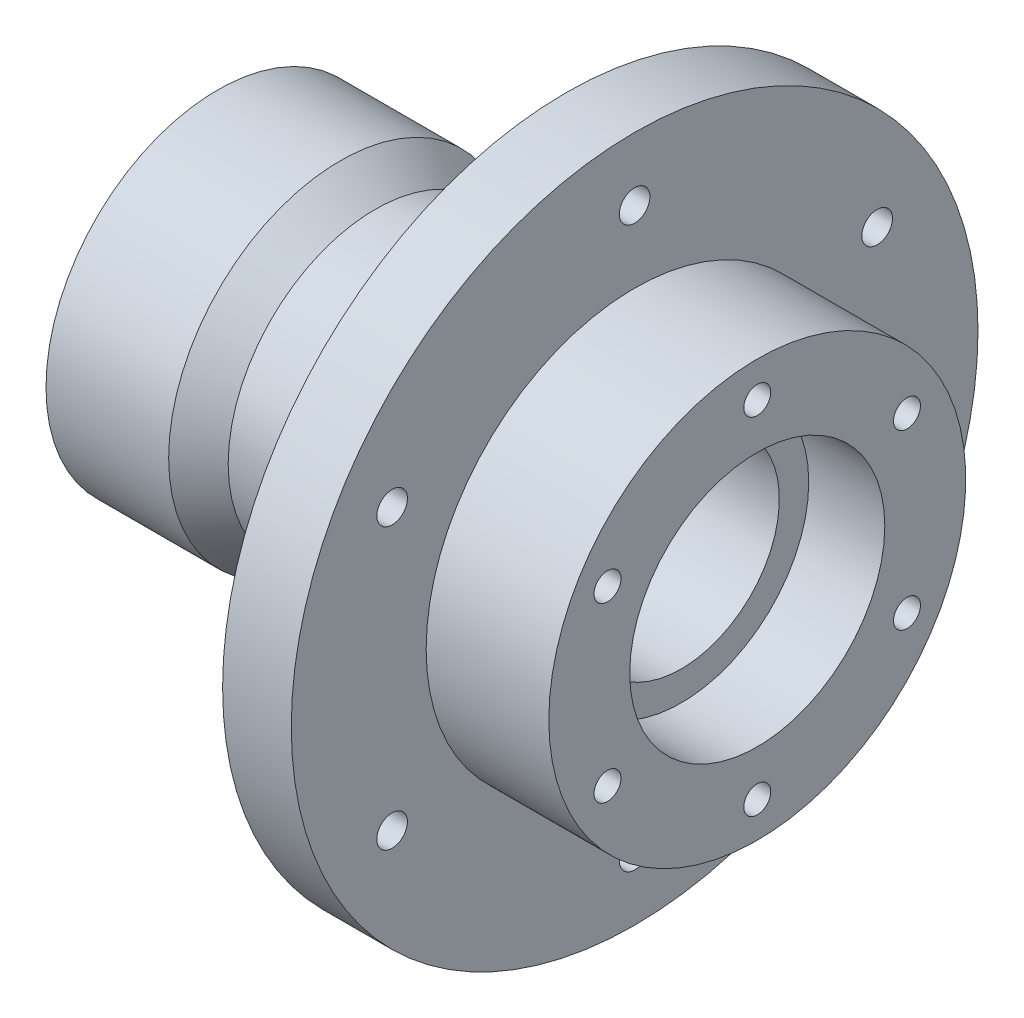
ISO-10303-21;
HEADER;
FILE_DESCRIPTION(('STEP AP214'),'2;1');
FILE_NAME('part.step','',(''),(''),'','','');
FILE_SCHEMA(('AUTOMOTIVE_DESIGN { 1 0 10303 214 1 1 1 1 }'));
ENDSEC;
DATA;
#1=APPLICATION_CONTEXT('core data for automotive mechanical design processes');
#2=APPLICATION_PROTOCOL_DEFINITION('international standard','automotive_design',2000,#1);
#3=PRODUCT_CONTEXT('',#1,'mechanical');
#4=PRODUCT('Part','Part','',(#3));
#5=PRODUCT_RELATED_PRODUCT_CATEGORY('part','',(#4));
#6=PRODUCT_DEFINITION_FORMATION('','',#4);
#7=PRODUCT_DEFINITION_CONTEXT('part definition',#1,'design');
#8=PRODUCT_DEFINITION('design','',#6,#7);
#9=PRODUCT_DEFINITION_SHAPE('','',#8);
#10=(LENGTH_UNIT() NAMED_UNIT(*) SI_UNIT(.MILLI.,.METRE.));
#11=(NAMED_UNIT(*) PLANE_ANGLE_UNIT() SI_UNIT($,.RADIAN.));
#12=(NAMED_UNIT(*) SI_UNIT($,.STERADIAN.) SOLID_ANGLE_UNIT());
#13=UNCERTAINTY_MEASURE_WITH_UNIT(LENGTH_MEASURE(1.E-05),#10,'distance_accuracy_value','');
#14=(GEOMETRIC_REPRESENTATION_CONTEXT(3) GLOBAL_UNCERTAINTY_ASSIGNED_CONTEXT((#13)) GLOBAL_UNIT_ASSIGNED_CONTEXT((#10,
#11,#12)) REPRESENTATION_CONTEXT('',''));
#15=CARTESIAN_POINT('',(0.,0.,0.));
#16=DIRECTION('',(0.,0.,1.));
#17=DIRECTION('',(1.,0.,0.));
#18=AXIS2_PLACEMENT_3D('',#15,#16,#17);
#19=CARTESIAN_POINT('',(0.,0.,0.));
#20=DIRECTION('',(-1.,0.,0.));
#21=DIRECTION('',(0.,0.,1.));
#22=AXIS2_PLACEMENT_3D('',#19,#20,#21);
#23=CYLINDRICAL_SURFACE('',#22,23.5);
#24=CARTESIAN_POINT('',(-27.2254716981132,0.,0.));
#25=DIRECTION('',(-1.,0.,0.));
#26=DIRECTION('',(0.,0.,1.));
#27=AXIS2_PLACEMENT_3D('',#24,#25,#26);
#28=CIRCLE('',#27,23.5);
#29=CARTESIAN_POINT('',(-27.2254716981132,0.,23.5));
#30=VERTEX_POINT('',#29);
#31=EDGE_CURVE('E242',#30,#30,#28,.T.);
#32=ORIENTED_EDGE('',*,*,#31,.F.);
#33=EDGE_LOOP('',(#32));
#34=FACE_BOUND('',#33,.T.);
#35=CARTESIAN_POINT('',(-41.2254716981132,0.,0.));
#36=DIRECTION('',(-1.,0.,0.));
#37=DIRECTION('',(0.,0.,1.));
#38=AXIS2_PLACEMENT_3D('',#35,#36,#37);
#39=CIRCLE('',#38,23.5);
#40=CARTESIAN_POINT('',(-41.2254716981132,0.,23.5));
#41=VERTEX_POINT('',#40);
#42=EDGE_CURVE('E180',#41,#41,#39,.T.);
#43=ORIENTED_EDGE('',*,*,#42,.T.);
#44=EDGE_LOOP('',(#43));
#45=FACE_BOUND('',#44,.T.);
#46=ADVANCED_FACE('F44',(#34,#45),#23,.F.);
#47=CARTESIAN_POINT('',(-27.2254716981132,0.,0.));
#48=DIRECTION('',(1.,0.,0.));
#49=DIRECTION('',(0.,0.,-1.));
#50=AXIS2_PLACEMENT_3D('',#47,#48,#49);
#51=PLANE('',#50);
#52=CARTESIAN_POINT('',(-27.2254716981132,0.,0.));
#53=DIRECTION('',(-1.,0.,0.));
#54=DIRECTION('',(0.,0.,1.));
#55=AXIS2_PLACEMENT_3D('',#52,#53,#54);
#56=CIRCLE('',#55,20.);
#57=CARTESIAN_POINT('',(-27.2254716981132,0.,20.));
#58=VERTEX_POINT('',#57);
#59=EDGE_CURVE('E238',#58,#58,#56,.T.);
#60=ORIENTED_EDGE('',*,*,#59,.F.);
#61=EDGE_LOOP('',(#60));
#62=FACE_BOUND('',#61,.T.);
#63=ORIENTED_EDGE('',*,*,#31,.T.);
#64=EDGE_LOOP('',(#63));
#65=FACE_BOUND('',#64,.T.);
#66=ADVANCED_FACE('F261',(#62,#65),#51,.F.);
#67=CARTESIAN_POINT('',(0.,0.,0.));
#68=DIRECTION('',(-1.,0.,0.));
#69=DIRECTION('',(0.,0.,1.));
#70=AXIS2_PLACEMENT_3D('',#67,#68,#69);
#71=CYLINDRICAL_SURFACE('',#70,20.);
#72=CARTESIAN_POINT('',(49.4245283018868,0.,0.));
#73=DIRECTION('',(-1.,0.,0.));
#74=DIRECTION('',(0.,0.,1.));
#75=AXIS2_PLACEMENT_3D('',#72,#73,#74);
#76=CIRCLE('',#75,20.);
#77=CARTESIAN_POINT('',(49.4245283018868,0.,20.));
#78=VERTEX_POINT('',#77);
#79=EDGE_CURVE('E234',#78,#78,#76,.T.);
#80=ORIENTED_EDGE('',*,*,#79,.F.);
#81=EDGE_LOOP('',(#80));
#82=FACE_BOUND('',#81,.T.);
#83=ORIENTED_EDGE('',*,*,#59,.T.);
#84=EDGE_LOOP('',(#83));
#85=FACE_BOUND('',#84,.T.);
#86=ADVANCED_FACE('F266',(#82,#85),#71,.F.);
#87=CARTESIAN_POINT('',(49.4245283018868,0.,0.));
#88=DIRECTION('',(-1.,0.,0.));
#89=DIRECTION('',(0.,0.,1.));
#90=AXIS2_PLACEMENT_3D('',#87,#88,#89);
#91=PLANE('',#90);
#92=CARTESIAN_POINT('',(49.4245283018868,0.,0.));
#93=DIRECTION('',(-1.,0.,0.));
#94=DIRECTION('',(0.,0.,1.));
#95=AXIS2_PLACEMENT_3D('',#92,#93,#94);
#96=CIRCLE('',#95,26.);
#97=CARTESIAN_POINT('',(49.4245283018868,0.,26.));
#98=VERTEX_POINT('',#97);
#99=EDGE_CURVE('E230',#98,#98,#96,.T.);
#100=ORIENTED_EDGE('',*,*,#99,.F.);
#101=EDGE_LOOP('',(#100));
#102=FACE_BOUND('',#101,.T.);
#103=ORIENTED_EDGE('',*,*,#79,.T.);
#104=EDGE_LOOP('',(#103));
#105=FACE_BOUND('',#104,.T.);
#106=ADVANCED_FACE('F274',(#102,#105),#91,.F.);
#107=CARTESIAN_POINT('',(0.,0.,0.));
#108=DIRECTION('',(-1.,0.,0.));
#109=DIRECTION('',(0.,0.,1.));
#110=AXIS2_PLACEMENT_3D('',#107,#108,#109);
#111=CYLINDRICAL_SURFACE('',#110,26.);
#112=CARTESIAN_POINT('',(64.9245283018868,0.,0.));
#113=DIRECTION('',(-1.,0.,0.));
#114=DIRECTION('',(0.,0.,1.));
#115=AXIS2_PLACEMENT_3D('',#112,#113,#114);
#116=CIRCLE('',#115,26.);
#117=CARTESIAN_POINT('',(64.9245283018868,0.,26.));
#118=VERTEX_POINT('',#117);
#119=EDGE_CURVE('E226',#118,#118,#116,.T.);
#120=ORIENTED_EDGE('',*,*,#119,.F.);
#121=EDGE_LOOP('',(#120));
#122=FACE_BOUND('',#121,.T.);
#123=ORIENTED_EDGE('',*,*,#99,.T.);
#124=EDGE_LOOP('',(#123));
#125=FACE_BOUND('',#124,.T.);
#126=ADVANCED_FACE('F278',(#122,#125),#111,.F.);
#127=CARTESIAN_POINT('',(64.9245283018868,0.,0.));
#128=DIRECTION('',(-1.,0.,0.));
#129=DIRECTION('',(0.,0.,1.));
#130=AXIS2_PLACEMENT_3D('',#127,#128,#129);
#131=PLANE('',#130);
#132=CARTESIAN_POINT('',(64.9245283018868,17.6250000000004,30.5273954834013));
#133=DIRECTION('',(1.,0.,0.));
#134=DIRECTION('',(0.,0.,-1.));
#135=AXIS2_PLACEMENT_3D('',#132,#133,#134);
#136=CIRCLE('',#135,2.74999999999999);
#137=CARTESIAN_POINT('',(64.9245283018868,17.6250000000004,27.7773954834013));
#138=VERTEX_POINT('',#137);
#139=EDGE_CURVE('E84',#138,#138,#136,.T.);
#140=ORIENTED_EDGE('',*,*,#139,.F.);
#141=EDGE_LOOP('',(#140));
#142=FACE_BOUND('',#141,.T.);
#143=CARTESIAN_POINT('',(64.9245283018868,-17.6249999999997,30.5273954834016));
#144=DIRECTION('',(1.,0.,0.));
#145=DIRECTION('',(0.,0.,-1.));
#146=AXIS2_PLACEMENT_3D('',#143,#144,#145);
#147=CIRCLE('',#146,2.74999999999999);
#148=CARTESIAN_POINT('',(64.9245283018868,-17.6249999999997,27.7773954834016));
#149=VERTEX_POINT('',#148);
#150=EDGE_CURVE('E83',#149,#149,#147,.T.);
#151=ORIENTED_EDGE('',*,*,#150,.F.);
#152=EDGE_LOOP('',(#151));
#153=FACE_BOUND('',#152,.T.);
#154=CARTESIAN_POINT('',(64.9245283018868,-35.25,0.));
#155=DIRECTION('',(1.,0.,0.));
#156=DIRECTION('',(0.,0.,-1.));
#157=AXIS2_PLACEMENT_3D('',#154,#155,#156);
#158=CIRCLE('',#157,2.74999999999999);
#159=CARTESIAN_POINT('',(64.9245283018868,-35.25,-2.74999999999999));
#160=VERTEX_POINT('',#159);
#161=EDGE_CURVE('E100',#160,#160,#158,.T.);
#162=ORIENTED_EDGE('',*,*,#161,.F.);
#163=EDGE_LOOP('',(#162));
#164=FACE_BOUND('',#163,.T.);
#165=CARTESIAN_POINT('',(64.9245283018868,-17.6250000000001,-30.5273954834014));
#166=DIRECTION('',(1.,0.,0.));
#167=DIRECTION('',(0.,0.,-1.));
#168=AXIS2_PLACEMENT_3D('',#165,#166,#167);
#169=CIRCLE('',#168,2.74999999999999);
#170=CARTESIAN_POINT('',(64.9245283018868,-17.6250000000001,-33.2773954834014));
#171=VERTEX_POINT('',#170);
#172=EDGE_CURVE('E108',#171,#171,#169,.T.);
#173=ORIENTED_EDGE('',*,*,#172,.F.);
#174=EDGE_LOOP('',(#173));
#175=FACE_BOUND('',#174,.T.);
#176=CARTESIAN_POINT('',(64.9245283018868,17.6249999999999,-30.5273954834015));
#177=DIRECTION('',(1.,0.,0.));
#178=DIRECTION('',(0.,0.,-1.));
#179=AXIS2_PLACEMENT_3D('',#176,#177,#178);
#180=CIRCLE('',#179,2.74999999999999);
#181=CARTESIAN_POINT('',(64.9245283018868,17.6249999999999,-33.2773954834015));
#182=VERTEX_POINT('',#181);
#183=EDGE_CURVE('E116',#182,#182,#180,.T.);
#184=ORIENTED_EDGE('',*,*,#183,.F.);
#185=EDGE_LOOP('',(#184));
#186=FACE_BOUND('',#185,.T.);
#187=CARTESIAN_POINT('',(64.9245283018868,35.25,0.));
#188=DIRECTION('',(1.,0.,0.));
#189=DIRECTION('',(0.,0.,-1.));
#190=AXIS2_PLACEMENT_3D('',#187,#188,#189);
#191=CIRCLE('',#190,2.74999999999999);
#192=CARTESIAN_POINT('',(64.9245283018868,35.25,-2.74999999999999));
#193=VERTEX_POINT('',#192);
#194=EDGE_CURVE('E164',#193,#193,#191,.T.);
#195=ORIENTED_EDGE('',*,*,#194,.F.);
#196=EDGE_LOOP('',(#195));
#197=FACE_BOUND('',#196,.T.);
#198=CARTESIAN_POINT('',(64.9245283018868,0.,0.));
#199=DIRECTION('',(-1.,0.,0.));
#200=DIRECTION('',(0.,0.,1.));
#201=AXIS2_PLACEMENT_3D('',#198,#199,#200);
#202=CIRCLE('',#201,42.5);
#203=CARTESIAN_POINT('',(64.9245283018868,0.,42.5));
#204=VERTEX_POINT('',#203);
#205=EDGE_CURVE('E222',#204,#204,#202,.T.);
#206=ORIENTED_EDGE('',*,*,#205,.F.);
#207=EDGE_LOOP('',(#206));
#208=FACE_BOUND('',#207,.T.);
#209=ORIENTED_EDGE('',*,*,#119,.T.);
#210=EDGE_LOOP('',(#209));
#211=FACE_BOUND('',#210,.T.);
#212=ADVANCED_FACE('F282',(#142,#153,#164,#175,#186,#197,#208,#211),#131,.F.);
#213=CARTESIAN_POINT('',(0.,0.,0.));
#214=DIRECTION('',(-1.,0.,0.));
#215=DIRECTION('',(0.,0.,1.));
#216=AXIS2_PLACEMENT_3D('',#213,#214,#215);
#217=CYLINDRICAL_SURFACE('',#216,42.5);
#218=CARTESIAN_POINT('',(39.9245283018868,0.,0.));
#219=DIRECTION('',(-1.,0.,0.));
#220=DIRECTION('',(0.,0.,1.));
#221=AXIS2_PLACEMENT_3D('',#218,#219,#220);
#222=CIRCLE('',#221,42.5);
#223=CARTESIAN_POINT('',(39.9245283018868,0.,42.5));
#224=VERTEX_POINT('',#223);
#225=EDGE_CURVE('E219',#224,#224,#222,.T.);
#226=ORIENTED_EDGE('',*,*,#225,.F.);
#227=EDGE_LOOP('',(#226));
#228=FACE_BOUND('',#227,.T.);
#229=ORIENTED_EDGE('',*,*,#205,.T.);
#230=EDGE_LOOP('',(#229));
#231=FACE_BOUND('',#230,.T.);
#232=ADVANCED_FACE('F286',(#228,#231),#217,.T.);
#233=CARTESIAN_POINT('',(39.9245283018868,0.,0.));
#234=DIRECTION('',(-1.,0.,0.));
#235=DIRECTION('',(0.,0.,1.));
#236=AXIS2_PLACEMENT_3D('',#233,#234,#235);
#237=PLANE('',#236);
#238=CARTESIAN_POINT('',(39.9245283018868,28.5450000000006,49.4413903020533));
#239=DIRECTION('',(1.,0.,0.));
#240=DIRECTION('',(0.,0.866025403784433,-0.50000000000001));
#241=AXIS2_PLACEMENT_3D('',#238,#239,#240);
#242=CIRCLE('',#241,3.125);
#243=CARTESIAN_POINT('',(39.9245283018868,31.2513293868269,47.8788903020532));
#244=VERTEX_POINT('',#243);
#245=EDGE_CURVE('E124',#244,#244,#242,.T.);
#246=ORIENTED_EDGE('',*,*,#245,.F.);
#247=EDGE_LOOP('',(#246));
#248=FACE_BOUND('',#247,.T.);
#249=CARTESIAN_POINT('',(39.9245283018868,-28.5449999999995,49.4413903020539));
#250=DIRECTION('',(1.,0.,0.));
#251=DIRECTION('',(0.,0.866025403784443,0.499999999999992));
#252=AXIS2_PLACEMENT_3D('',#249,#250,#251);
#253=CIRCLE('',#252,3.125);
#254=CARTESIAN_POINT('',(39.9245283018868,-25.8386706131732,51.0038903020538));
#255=VERTEX_POINT('',#254);
#256=EDGE_CURVE('E143',#255,#255,#253,.T.);
#257=ORIENTED_EDGE('',*,*,#256,.F.);
#258=EDGE_LOOP('',(#257));
#259=FACE_BOUND('',#258,.T.);
#260=CARTESIAN_POINT('',(39.9245283018868,-57.09,0.));
#261=DIRECTION('',(1.,0.,0.));
#262=DIRECTION('',(0.,0.,1.));
#263=AXIS2_PLACEMENT_3D('',#260,#261,#262);
#264=CIRCLE('',#263,3.125);
#265=CARTESIAN_POINT('',(39.9245283018868,-57.09,3.125));
#266=VERTEX_POINT('',#265);
#267=EDGE_CURVE('E135',#266,#266,#264,.T.);
#268=ORIENTED_EDGE('',*,*,#267,.F.);
#269=EDGE_LOOP('',(#268));
#270=FACE_BOUND('',#269,.T.);
#271=CARTESIAN_POINT('',(39.9245283018868,-28.5450000000002,-49.4413903020535));
#272=DIRECTION('',(1.,0.,0.));
#273=DIRECTION('',(0.,-0.866025403784436,0.500000000000004));
#274=AXIS2_PLACEMENT_3D('',#271,#272,#273);
#275=CIRCLE('',#274,3.125);
#276=CARTESIAN_POINT('',(39.9245283018868,-31.2513293868266,-47.8788903020535));
#277=VERTEX_POINT('',#276);
#278=EDGE_CURVE('E125',#277,#277,#275,.T.);
#279=ORIENTED_EDGE('',*,*,#278,.F.);
#280=EDGE_LOOP('',(#279));
#281=FACE_BOUND('',#280,.T.);
#282=CARTESIAN_POINT('',(39.9245283018868,28.5449999999999,-49.4413903020537));
#283=DIRECTION('',(1.,0.,0.));
#284=DIRECTION('',(0.,-0.86602540378444,-0.499999999999998));
#285=AXIS2_PLACEMENT_3D('',#282,#283,#284);
#286=CIRCLE('',#285,3.125);
#287=CARTESIAN_POINT('',(39.9245283018868,25.8386706131735,-51.0038903020537));
#288=VERTEX_POINT('',#287);
#289=EDGE_CURVE('E134',#288,#288,#286,.T.);
#290=ORIENTED_EDGE('',*,*,#289,.F.);
#291=EDGE_LOOP('',(#290));
#292=FACE_BOUND('',#291,.T.);
#293=CARTESIAN_POINT('',(39.9245283018868,57.09,0.));
#294=DIRECTION('',(1.,0.,0.));
#295=DIRECTION('',(0.,0.,-1.));
#296=AXIS2_PLACEMENT_3D('',#293,#294,#295);
#297=CIRCLE('',#296,3.125);
#298=CARTESIAN_POINT('',(39.9245283018868,57.09,-3.125));
#299=VERTEX_POINT('',#298);
#300=EDGE_CURVE('E172',#299,#299,#297,.T.);
#301=ORIENTED_EDGE('',*,*,#300,.F.);
#302=EDGE_LOOP('',(#301));
#303=FACE_BOUND('',#302,.T.);
#304=CARTESIAN_POINT('',(39.9245283018868,0.,0.));
#305=DIRECTION('',(-1.,0.,0.));
#306=DIRECTION('',(0.,0.,1.));
#307=AXIS2_PLACEMENT_3D('',#304,#305,#306);
#308=CIRCLE('',#307,70.);
#309=CARTESIAN_POINT('',(39.9245283018868,0.,70.));
#310=VERTEX_POINT('',#309);
#311=EDGE_CURVE('E215',#310,#310,#308,.T.);
#312=ORIENTED_EDGE('',*,*,#311,.F.);
#313=EDGE_LOOP('',(#312));
#314=FACE_BOUND('',#313,.T.);
#315=ORIENTED_EDGE('',*,*,#225,.T.);
#316=EDGE_LOOP('',(#315));
#317=FACE_BOUND('',#316,.T.);
#318=ADVANCED_FACE('F290',(#248,#259,#270,#281,#292,#303,#314,#317),#237,.F.);
#319=CARTESIAN_POINT('',(0.,0.,0.));
#320=DIRECTION('',(-1.,0.,0.));
#321=DIRECTION('',(0.,0.,1.));
#322=AXIS2_PLACEMENT_3D('',#319,#320,#321);
#323=CYLINDRICAL_SURFACE('',#322,70.);
#324=CARTESIAN_POINT('',(25.9245283018868,0.,0.));
#325=DIRECTION('',(-1.,0.,0.));
#326=DIRECTION('',(0.,0.,1.));
#327=AXIS2_PLACEMENT_3D('',#324,#325,#326);
#328=CIRCLE('',#327,70.);
#329=CARTESIAN_POINT('',(25.9245283018868,0.,70.));
#330=VERTEX_POINT('',#329);
#331=EDGE_CURVE('E211',#330,#330,#328,.T.);
#332=ORIENTED_EDGE('',*,*,#331,.F.);
#333=EDGE_LOOP('',(#332));
#334=FACE_BOUND('',#333,.T.);
#335=ORIENTED_EDGE('',*,*,#311,.T.);
#336=EDGE_LOOP('',(#335));
#337=FACE_BOUND('',#336,.T.);
#338=ADVANCED_FACE('F294',(#334,#337),#323,.T.);
#339=CARTESIAN_POINT('',(25.9245283018868,0.,0.));
#340=DIRECTION('',(1.,0.,0.));
#341=DIRECTION('',(0.,0.,-1.));
#342=AXIS2_PLACEMENT_3D('',#339,#340,#341);
#343=PLANE('',#342);
#344=CARTESIAN_POINT('',(25.9245283018868,0.,0.));
#345=DIRECTION('',(1.,0.,0.));
#346=DIRECTION('',(0.,0.,-1.));
#347=AXIS2_PLACEMENT_3D('',#344,#345,#346);
#348=CIRCLE('',#347,33.);
#349=CARTESIAN_POINT('',(25.9245283018868,0.,-33.));
#350=VERTEX_POINT('',#349);
#351=EDGE_CURVE('E11',#350,#350,#348,.T.);
#352=ORIENTED_EDGE('',*,*,#351,.T.);
#353=EDGE_LOOP('',(#352));
#354=FACE_BOUND('',#353,.T.);
#355=CARTESIAN_POINT('',(25.9245283018868,28.5450000000006,49.4413903020533));
#356=DIRECTION('',(1.,0.,0.));
#357=DIRECTION('',(0.,0.,-1.));
#358=AXIS2_PLACEMENT_3D('',#355,#356,#357);
#359=CIRCLE('',#358,3.125);
#360=CARTESIAN_POINT('',(25.9245283018868,28.5450000000006,46.3163903020533));
#361=VERTEX_POINT('',#360);
#362=EDGE_CURVE('E147',#361,#361,#359,.F.);
#363=ORIENTED_EDGE('',*,*,#362,.F.);
#364=EDGE_LOOP('',(#363));
#365=FACE_BOUND('',#364,.T.);
#366=CARTESIAN_POINT('',(25.9245283018868,-28.5449999999995,49.4413903020539));
#367=DIRECTION('',(1.,0.,0.));
#368=DIRECTION('',(0.,0.,-1.));
#369=AXIS2_PLACEMENT_3D('',#366,#367,#368);
#370=CIRCLE('',#369,3.125);
#371=CARTESIAN_POINT('',(25.9245283018868,-28.5449999999995,46.3163903020539));
#372=VERTEX_POINT('',#371);
#373=EDGE_CURVE('E139',#372,#372,#370,.F.);
#374=ORIENTED_EDGE('',*,*,#373,.F.);
#375=EDGE_LOOP('',(#374));
#376=FACE_BOUND('',#375,.T.);
#377=CARTESIAN_POINT('',(25.9245283018868,-57.09,0.));
#378=DIRECTION('',(1.,0.,0.));
#379=DIRECTION('',(0.,0.,-1.));
#380=AXIS2_PLACEMENT_3D('',#377,#378,#379);
#381=CIRCLE('',#380,3.125);
#382=CARTESIAN_POINT('',(25.9245283018868,-57.09,-3.125));
#383=VERTEX_POINT('',#382);
#384=EDGE_CURVE('E130',#383,#383,#381,.F.);
#385=ORIENTED_EDGE('',*,*,#384,.F.);
#386=EDGE_LOOP('',(#385));
#387=FACE_BOUND('',#386,.T.);
#388=CARTESIAN_POINT('',(25.9245283018868,-28.5450000000002,-49.4413903020535));
#389=DIRECTION('',(1.,0.,0.));
#390=DIRECTION('',(0.,0.,-1.));
#391=AXIS2_PLACEMENT_3D('',#388,#389,#390);
#392=CIRCLE('',#391,3.125);
#393=CARTESIAN_POINT('',(25.9245283018868,-28.5450000000002,-52.5663903020535));
#394=VERTEX_POINT('',#393);
#395=EDGE_CURVE('E129',#394,#394,#392,.F.);
#396=ORIENTED_EDGE('',*,*,#395,.F.);
#397=EDGE_LOOP('',(#396));
#398=FACE_BOUND('',#397,.T.);
#399=CARTESIAN_POINT('',(25.9245283018868,28.5449999999999,-49.4413903020537));
#400=DIRECTION('',(1.,0.,0.));
#401=DIRECTION('',(0.,0.,-1.));
#402=AXIS2_PLACEMENT_3D('',#399,#400,#401);
#403=CIRCLE('',#402,3.125);
#404=CARTESIAN_POINT('',(25.9245283018868,28.5449999999999,-52.5663903020537));
#405=VERTEX_POINT('',#404);
#406=EDGE_CURVE('E160',#405,#405,#403,.F.);
#407=ORIENTED_EDGE('',*,*,#406,.F.);
#408=EDGE_LOOP('',(#407));
#409=FACE_BOUND('',#408,.T.);
#410=CARTESIAN_POINT('',(25.9245283018868,57.09,0.));
#411=DIRECTION('',(1.,0.,0.));
#412=DIRECTION('',(0.,0.,-1.));
#413=AXIS2_PLACEMENT_3D('',#410,#411,#412);
#414=CIRCLE('',#413,3.125);
#415=CARTESIAN_POINT('',(25.9245283018868,57.09,-3.125));
#416=VERTEX_POINT('',#415);
#417=EDGE_CURVE('E176',#416,#416,#414,.F.);
#418=ORIENTED_EDGE('',*,*,#417,.F.);
#419=EDGE_LOOP('',(#418));
#420=FACE_BOUND('',#419,.T.);
#421=ORIENTED_EDGE('',*,*,#331,.T.);
#422=EDGE_LOOP('',(#421));
#423=FACE_BOUND('',#422,.T.);
#424=ADVANCED_FACE('F298',(#354,#365,#376,#387,#398,#409,#420,#423),#343,.F.);
#425=CARTESIAN_POINT('',(0.,0.,0.));
#426=DIRECTION('',(-1.,0.,0.));
#427=DIRECTION('',(0.,0.,1.));
#428=AXIS2_PLACEMENT_3D('',#425,#426,#427);
#429=CYLINDRICAL_SURFACE('',#428,30.);
#430=CARTESIAN_POINT('',(22.9245283018868,0.,0.));
#431=DIRECTION('',(1.,0.,0.));
#432=DIRECTION('',(0.,0.,-1.));
#433=AXIS2_PLACEMENT_3D('',#430,#431,#432);
#434=CIRCLE('',#433,30.);
#435=CARTESIAN_POINT('',(22.9245283018868,0.,-30.));
#436=VERTEX_POINT('',#435);
#437=EDGE_CURVE('E53',#436,#436,#434,.F.);
#438=ORIENTED_EDGE('',*,*,#437,.T.);
#439=EDGE_LOOP('',(#438));
#440=FACE_BOUND('',#439,.T.);
#441=CARTESIAN_POINT('',(-12.9347316644025,0.,0.));
#442=DIRECTION('',(-1.,0.,0.));
#443=DIRECTION('',(0.,0.,1.));
#444=AXIS2_PLACEMENT_3D('',#441,#442,#443);
#445=CIRCLE('',#444,30.);
#446=CARTESIAN_POINT('',(-12.9347316644025,0.,30.));
#447=VERTEX_POINT('',#446);
#448=EDGE_CURVE('E207',#447,#447,#445,.T.);
#449=ORIENTED_EDGE('',*,*,#448,.F.);
#450=EDGE_LOOP('',(#449));
#451=FACE_BOUND('',#450,.T.);
#452=ADVANCED_FACE('F250',(#440,#451),#429,.T.);
#453=CARTESIAN_POINT('',(-12.9347316644025,0.,0.));
#454=DIRECTION('',(-1.,0.,0.));
#455=DIRECTION('',(0.,0.,1.));
#456=AXIS2_PLACEMENT_3D('',#453,#454,#455);
#457=CONICAL_SURFACE('',#456,30.,0.610865238198009);
#458=CARTESIAN_POINT('',(-20.0754716981132,0.,0.));
#459=DIRECTION('',(-1.,0.,0.));
#460=DIRECTION('',(0.,0.,1.));
#461=AXIS2_PLACEMENT_3D('',#458,#459,#460);
#462=CIRCLE('',#461,35.);
#463=CARTESIAN_POINT('',(-20.0754716981132,0.,35.));
#464=VERTEX_POINT('',#463);
#465=EDGE_CURVE('E203',#464,#464,#462,.T.);
#466=ORIENTED_EDGE('',*,*,#465,.F.);
#467=EDGE_LOOP('',(#466));
#468=FACE_BOUND('',#467,.T.);
#469=ORIENTED_EDGE('',*,*,#448,.T.);
#470=EDGE_LOOP('',(#469));
#471=FACE_BOUND('',#470,.T.);
#472=ADVANCED_FACE('F305',(#468,#471),#457,.T.);
#473=CARTESIAN_POINT('',(0.,0.,0.));
#474=DIRECTION('',(-1.,0.,0.));
#475=DIRECTION('',(0.,0.,1.));
#476=AXIS2_PLACEMENT_3D('',#473,#474,#475);
#477=CYLINDRICAL_SURFACE('',#476,35.);
#478=CARTESIAN_POINT('',(-45.0754716981132,0.,0.));
#479=DIRECTION('',(-1.,0.,0.));
#480=DIRECTION('',(0.,0.,1.));
#481=AXIS2_PLACEMENT_3D('',#478,#479,#480);
#482=CIRCLE('',#481,35.);
#483=CARTESIAN_POINT('',(-45.0754716981132,0.,35.));
#484=VERTEX_POINT('',#483);
#485=EDGE_CURVE('E199',#484,#484,#482,.T.);
#486=ORIENTED_EDGE('',*,*,#485,.F.);
#487=EDGE_LOOP('',(#486));
#488=FACE_BOUND('',#487,.T.);
#489=ORIENTED_EDGE('',*,*,#465,.T.);
#490=EDGE_LOOP('',(#489));
#491=FACE_BOUND('',#490,.T.);
#492=ADVANCED_FACE('F308',(#488,#491),#477,.T.);
#493=CARTESIAN_POINT('',(-45.0754716981132,0.,0.));
#494=DIRECTION('',(1.,0.,0.));
#495=DIRECTION('',(0.,0.,-1.));
#496=AXIS2_PLACEMENT_3D('',#493,#494,#495);
#497=PLANE('',#496);
#498=CARTESIAN_POINT('',(-45.0754716981132,0.,0.));
#499=DIRECTION('',(-1.,0.,0.));
#500=DIRECTION('',(0.,0.,1.));
#501=AXIS2_PLACEMENT_3D('',#498,#499,#500);
#502=CIRCLE('',#501,23.5);
#503=CARTESIAN_POINT('',(-45.0754716981132,0.,23.5));
#504=VERTEX_POINT('',#503);
#505=EDGE_CURVE('E195',#504,#504,#502,.T.);
#506=ORIENTED_EDGE('',*,*,#505,.F.);
#507=EDGE_LOOP('',(#506));
#508=FACE_BOUND('',#507,.T.);
#509=ORIENTED_EDGE('',*,*,#485,.T.);
#510=EDGE_LOOP('',(#509));
#511=FACE_BOUND('',#510,.T.);
#512=ADVANCED_FACE('F312',(#508,#511),#497,.F.);
#513=CARTESIAN_POINT('',(0.,0.,0.));
#514=DIRECTION('',(-1.,0.,0.));
#515=DIRECTION('',(0.,0.,1.));
#516=AXIS2_PLACEMENT_3D('',#513,#514,#515);
#517=CYLINDRICAL_SURFACE('',#516,23.5);
#518=CARTESIAN_POINT('',(-43.0754716981132,0.,0.));
#519=DIRECTION('',(-1.,0.,0.));
#520=DIRECTION('',(0.,0.,1.));
#521=AXIS2_PLACEMENT_3D('',#518,#519,#520);
#522=CIRCLE('',#521,23.5);
#523=CARTESIAN_POINT('',(-43.0754716981132,0.,23.5));
#524=VERTEX_POINT('',#523);
#525=EDGE_CURVE('E191',#524,#524,#522,.T.);
#526=ORIENTED_EDGE('',*,*,#525,.F.);
#527=EDGE_LOOP('',(#526));
#528=FACE_BOUND('',#527,.T.);
#529=ORIENTED_EDGE('',*,*,#505,.T.);
#530=EDGE_LOOP('',(#529));
#531=FACE_BOUND('',#530,.T.);
#532=ADVANCED_FACE('F316',(#528,#531),#517,.F.);
#533=CARTESIAN_POINT('',(-43.0754716981132,0.,0.));
#534=DIRECTION('',(-1.,0.,0.));
#535=DIRECTION('',(0.,0.,1.));
#536=AXIS2_PLACEMENT_3D('',#533,#534,#535);
#537=PLANE('',#536);
#538=CARTESIAN_POINT('',(-43.0754716981132,0.,0.));
#539=DIRECTION('',(-1.,0.,0.));
#540=DIRECTION('',(0.,0.,1.));
#541=AXIS2_PLACEMENT_3D('',#538,#539,#540);
#542=CIRCLE('',#541,24.75);
#543=CARTESIAN_POINT('',(-43.0754716981132,0.,24.75));
#544=VERTEX_POINT('',#543);
#545=EDGE_CURVE('E188',#544,#544,#542,.T.);
#546=ORIENTED_EDGE('',*,*,#545,.F.);
#547=EDGE_LOOP('',(#546));
#548=FACE_BOUND('',#547,.T.);
#549=ORIENTED_EDGE('',*,*,#525,.T.);
#550=EDGE_LOOP('',(#549));
#551=FACE_BOUND('',#550,.T.);
#552=ADVANCED_FACE('F320',(#548,#551),#537,.F.);
#553=CARTESIAN_POINT('',(0.,0.,0.));
#554=DIRECTION('',(-1.,0.,0.));
#555=DIRECTION('',(0.,0.,1.));
#556=AXIS2_PLACEMENT_3D('',#553,#554,#555);
#557=CYLINDRICAL_SURFACE('',#556,24.75);
#558=CARTESIAN_POINT('',(-41.2254716981132,0.,0.));
#559=DIRECTION('',(-1.,0.,0.));
#560=DIRECTION('',(0.,0.,1.));
#561=AXIS2_PLACEMENT_3D('',#558,#559,#560);
#562=CIRCLE('',#561,24.75);
#563=CARTESIAN_POINT('',(-41.2254716981132,0.,24.75));
#564=VERTEX_POINT('',#563);
#565=EDGE_CURVE('E184',#564,#564,#562,.T.);
#566=ORIENTED_EDGE('',*,*,#565,.F.);
#567=EDGE_LOOP('',(#566));
#568=FACE_BOUND('',#567,.T.);
#569=ORIENTED_EDGE('',*,*,#545,.T.);
#570=EDGE_LOOP('',(#569));
#571=FACE_BOUND('',#570,.T.);
#572=ADVANCED_FACE('F324',(#568,#571),#557,.F.);
#573=CARTESIAN_POINT('',(-41.2254716981132,-2.28847339401389E-13,0.));
#574=DIRECTION('',(1.,0.,0.));
#575=DIRECTION('',(0.,0.,-1.));
#576=AXIS2_PLACEMENT_3D('',#573,#574,#575);
#577=PLANE('',#576);
#578=ORIENTED_EDGE('',*,*,#42,.F.);
#579=EDGE_LOOP('',(#578));
#580=FACE_BOUND('',#579,.T.);
#581=ORIENTED_EDGE('',*,*,#565,.T.);
#582=EDGE_LOOP('',(#581));
#583=FACE_BOUND('',#582,.T.);
#584=ADVANCED_FACE('F328',(#580,#583),#577,.F.);
#585=CARTESIAN_POINT('',(17.085693537055,57.09,0.));
#586=DIRECTION('',(1.,0.,0.));
#587=DIRECTION('',(0.,0.,-1.));
#588=AXIS2_PLACEMENT_3D('',#585,#586,#587);
#589=CYLINDRICAL_SURFACE('',#588,3.125);
#590=ORIENTED_EDGE('',*,*,#417,.T.);
#591=EDGE_LOOP('',(#590));
#592=FACE_BOUND('',#591,.T.);
#593=ORIENTED_EDGE('',*,*,#300,.T.);
#594=EDGE_LOOP('',(#593));
#595=FACE_BOUND('',#594,.T.);
#596=ADVANCED_FACE('F332',(#592,#595),#589,.F.);
#597=CARTESIAN_POINT('',(54.5768950042126,35.25,0.));
#598=DIRECTION('',(1.,0.,0.));
#599=DIRECTION('',(0.,0.,-1.));
#600=AXIS2_PLACEMENT_3D('',#597,#598,#599);
#601=CONICAL_SURFACE('',#600,2.75,1.02974425867665);
#602=CARTESIAN_POINT('',(52.9245283018868,35.25,0.));
#603=VERTEX_POINT('',#602);
#604=VERTEX_LOOP('',#603);
#605=FACE_BOUND('',#604,.T.);
#606=CARTESIAN_POINT('',(54.5768950042126,35.25,0.));
#607=DIRECTION('',(1.,0.,0.));
#608=DIRECTION('',(0.,0.,-1.));
#609=AXIS2_PLACEMENT_3D('',#606,#607,#608);
#610=CIRCLE('',#609,2.75);
#611=CARTESIAN_POINT('',(54.5768950042126,35.25,-2.75));
#612=VERTEX_POINT('',#611);
#613=EDGE_CURVE('E168',#612,#612,#610,.T.);
#614=ORIENTED_EDGE('',*,*,#613,.T.);
#615=EDGE_LOOP('',(#614));
#616=FACE_BOUND('',#615,.T.);
#617=ADVANCED_FACE('F336',(#605,#616),#601,.F.);
#618=CARTESIAN_POINT('',(64.9245283018868,35.25,0.));
#619=DIRECTION('',(1.,0.,0.));
#620=DIRECTION('',(0.,0.,-1.));
#621=AXIS2_PLACEMENT_3D('',#618,#619,#620);
#622=CYLINDRICAL_SURFACE('',#621,2.74999999999999);
#623=ORIENTED_EDGE('',*,*,#613,.F.);
#624=EDGE_LOOP('',(#623));
#625=FACE_BOUND('',#624,.T.);
#626=ORIENTED_EDGE('',*,*,#194,.T.);
#627=EDGE_LOOP('',(#626));
#628=FACE_BOUND('',#627,.T.);
#629=ADVANCED_FACE('F340',(#625,#628),#622,.F.);
#630=CARTESIAN_POINT('',(17.085693537055,28.5449999999999,-49.4413903020537));
#631=DIRECTION('',(1.,0.,0.));
#632=DIRECTION('',(0.,0.,-1.));
#633=AXIS2_PLACEMENT_3D('',#630,#631,#632);
#634=CYLINDRICAL_SURFACE('',#633,3.125);
#635=ORIENTED_EDGE('',*,*,#406,.T.);
#636=EDGE_LOOP('',(#635));
#637=FACE_BOUND('',#636,.T.);
#638=ORIENTED_EDGE('',*,*,#289,.T.);
#639=EDGE_LOOP('',(#638));
#640=FACE_BOUND('',#639,.T.);
#641=ADVANCED_FACE('F343',(#637,#640),#634,.F.);
#642=CARTESIAN_POINT('',(17.0856935370549,-28.5450000000002,-49.4413903020535));
#643=DIRECTION('',(1.,0.,0.));
#644=DIRECTION('',(0.,0.,-1.));
#645=AXIS2_PLACEMENT_3D('',#642,#643,#644);
#646=CYLINDRICAL_SURFACE('',#645,3.125);
#647=ORIENTED_EDGE('',*,*,#395,.T.);
#648=EDGE_LOOP('',(#647));
#649=FACE_BOUND('',#648,.T.);
#650=ORIENTED_EDGE('',*,*,#278,.T.);
#651=EDGE_LOOP('',(#650));
#652=FACE_BOUND('',#651,.T.);
#653=ADVANCED_FACE('F347',(#649,#652),#646,.F.);
#654=CARTESIAN_POINT('',(17.085693537055,-57.09,0.));
#655=DIRECTION('',(1.,0.,0.));
#656=DIRECTION('',(0.,0.,-1.));
#657=AXIS2_PLACEMENT_3D('',#654,#655,#656);
#658=CYLINDRICAL_SURFACE('',#657,3.125);
#659=ORIENTED_EDGE('',*,*,#384,.T.);
#660=EDGE_LOOP('',(#659));
#661=FACE_BOUND('',#660,.T.);
#662=ORIENTED_EDGE('',*,*,#267,.T.);
#663=EDGE_LOOP('',(#662));
#664=FACE_BOUND('',#663,.T.);
#665=ADVANCED_FACE('F357',(#661,#664),#658,.F.);
#666=CARTESIAN_POINT('',(17.085693537055,-28.5449999999995,49.4413903020539));
#667=DIRECTION('',(1.,0.,0.));
#668=DIRECTION('',(0.,0.,-1.));
#669=AXIS2_PLACEMENT_3D('',#666,#667,#668);
#670=CYLINDRICAL_SURFACE('',#669,3.125);
#671=ORIENTED_EDGE('',*,*,#373,.T.);
#672=EDGE_LOOP('',(#671));
#673=FACE_BOUND('',#672,.T.);
#674=ORIENTED_EDGE('',*,*,#256,.T.);
#675=EDGE_LOOP('',(#674));
#676=FACE_BOUND('',#675,.T.);
#677=ADVANCED_FACE('F353',(#673,#676),#670,.F.);
#678=CARTESIAN_POINT('',(17.0856935370549,28.5450000000006,49.4413903020533));
#679=DIRECTION('',(1.,0.,0.));
#680=DIRECTION('',(0.,0.,-1.));
#681=AXIS2_PLACEMENT_3D('',#678,#679,#680);
#682=CYLINDRICAL_SURFACE('',#681,3.125);
#683=ORIENTED_EDGE('',*,*,#362,.T.);
#684=EDGE_LOOP('',(#683));
#685=FACE_BOUND('',#684,.T.);
#686=ORIENTED_EDGE('',*,*,#245,.T.);
#687=EDGE_LOOP('',(#686));
#688=FACE_BOUND('',#687,.T.);
#689=ADVANCED_FACE('F349',(#685,#688),#682,.F.);
#690=CARTESIAN_POINT('',(54.5768950042126,17.6249999999999,-30.5273954834015));
#691=DIRECTION('',(1.,0.,0.));
#692=DIRECTION('',(0.,0.,-1.));
#693=AXIS2_PLACEMENT_3D('',#690,#691,#692);
#694=CONICAL_SURFACE('',#693,2.75,1.02974425867665);
#695=CARTESIAN_POINT('',(52.9245283018868,17.6249999999999,-30.5273954834015));
#696=VERTEX_POINT('',#695);
#697=VERTEX_LOOP('',#696);
#698=FACE_BOUND('',#697,.T.);
#699=CARTESIAN_POINT('',(54.5768950042126,17.6249999999999,-30.5273954834015));
#700=DIRECTION('',(1.,0.,0.));
#701=DIRECTION('',(0.,0.,-1.));
#702=AXIS2_PLACEMENT_3D('',#699,#700,#701);
#703=CIRCLE('',#702,2.75);
#704=CARTESIAN_POINT('',(54.5768950042126,17.6249999999999,-33.2773954834015));
#705=VERTEX_POINT('',#704);
#706=EDGE_CURVE('E120',#705,#705,#703,.T.);
#707=ORIENTED_EDGE('',*,*,#706,.T.);
#708=EDGE_LOOP('',(#707));
#709=FACE_BOUND('',#708,.T.);
#710=ADVANCED_FACE('F352',(#698,#709),#694,.F.);
#711=CARTESIAN_POINT('',(64.9245283018868,17.6249999999999,-30.5273954834015));
#712=DIRECTION('',(1.,0.,0.));
#713=DIRECTION('',(0.,0.,-1.));
#714=AXIS2_PLACEMENT_3D('',#711,#712,#713);
#715=CYLINDRICAL_SURFACE('',#714,2.75);
#716=ORIENTED_EDGE('',*,*,#706,.F.);
#717=EDGE_LOOP('',(#716));
#718=FACE_BOUND('',#717,.T.);
#719=ORIENTED_EDGE('',*,*,#183,.T.);
#720=EDGE_LOOP('',(#719));
#721=FACE_BOUND('',#720,.T.);
#722=ADVANCED_FACE('F367',(#718,#721),#715,.F.);
#723=CARTESIAN_POINT('',(54.5768950042126,-17.6250000000001,-30.5273954834014));
#724=DIRECTION('',(1.,0.,0.));
#725=DIRECTION('',(0.,0.,-1.));
#726=AXIS2_PLACEMENT_3D('',#723,#724,#725);
#727=CONICAL_SURFACE('',#726,2.75,1.02974425867665);
#728=CARTESIAN_POINT('',(52.9245283018868,-17.6250000000001,-30.5273954834014));
#729=VERTEX_POINT('',#728);
#730=VERTEX_LOOP('',#729);
#731=FACE_BOUND('',#730,.T.);
#732=CARTESIAN_POINT('',(54.5768950042126,-17.6250000000001,-30.5273954834014));
#733=DIRECTION('',(1.,0.,0.));
#734=DIRECTION('',(0.,0.,-1.));
#735=AXIS2_PLACEMENT_3D('',#732,#733,#734);
#736=CIRCLE('',#735,2.75);
#737=CARTESIAN_POINT('',(54.5768950042126,-17.6250000000001,-33.2773954834014));
#738=VERTEX_POINT('',#737);
#739=EDGE_CURVE('E112',#738,#738,#736,.T.);
#740=ORIENTED_EDGE('',*,*,#739,.T.);
#741=EDGE_LOOP('',(#740));
#742=FACE_BOUND('',#741,.T.);
#743=ADVANCED_FACE('F370',(#731,#742),#727,.F.);
#744=CARTESIAN_POINT('',(64.9245283018868,-17.6250000000001,-30.5273954834014));
#745=DIRECTION('',(1.,0.,0.));
#746=DIRECTION('',(0.,0.,-1.));
#747=AXIS2_PLACEMENT_3D('',#744,#745,#746);
#748=CYLINDRICAL_SURFACE('',#747,2.74999999999999);
#749=ORIENTED_EDGE('',*,*,#739,.F.);
#750=EDGE_LOOP('',(#749));
#751=FACE_BOUND('',#750,.T.);
#752=ORIENTED_EDGE('',*,*,#172,.T.);
#753=EDGE_LOOP('',(#752));
#754=FACE_BOUND('',#753,.T.);
#755=ADVANCED_FACE('F374',(#751,#754),#748,.F.);
#756=CARTESIAN_POINT('',(54.5768950042126,-35.25,0.));
#757=DIRECTION('',(1.,0.,0.));
#758=DIRECTION('',(0.,0.,-1.));
#759=AXIS2_PLACEMENT_3D('',#756,#757,#758);
#760=CONICAL_SURFACE('',#759,2.75,1.02974425867665);
#761=CARTESIAN_POINT('',(52.9245283018868,-35.25,0.));
#762=VERTEX_POINT('',#761);
#763=VERTEX_LOOP('',#762);
#764=FACE_BOUND('',#763,.T.);
#765=CARTESIAN_POINT('',(54.5768950042126,-35.25,0.));
#766=DIRECTION('',(1.,0.,0.));
#767=DIRECTION('',(0.,0.,-1.));
#768=AXIS2_PLACEMENT_3D('',#765,#766,#767);
#769=CIRCLE('',#768,2.75);
#770=CARTESIAN_POINT('',(54.5768950042126,-35.25,-2.75));
#771=VERTEX_POINT('',#770);
#772=EDGE_CURVE('E104',#771,#771,#769,.T.);
#773=ORIENTED_EDGE('',*,*,#772,.T.);
#774=EDGE_LOOP('',(#773));
#775=FACE_BOUND('',#774,.T.);
#776=ADVANCED_FACE('F378',(#764,#775),#760,.F.);
#777=CARTESIAN_POINT('',(64.9245283018868,-35.25,0.));
#778=DIRECTION('',(1.,0.,0.));
#779=DIRECTION('',(0.,0.,-1.));
#780=AXIS2_PLACEMENT_3D('',#777,#778,#779);
#781=CYLINDRICAL_SURFACE('',#780,2.74999999999999);
#782=ORIENTED_EDGE('',*,*,#772,.F.);
#783=EDGE_LOOP('',(#782));
#784=FACE_BOUND('',#783,.T.);
#785=ORIENTED_EDGE('',*,*,#161,.T.);
#786=EDGE_LOOP('',(#785));
#787=FACE_BOUND('',#786,.T.);
#788=ADVANCED_FACE('F382',(#784,#787),#781,.F.);
#789=CARTESIAN_POINT('',(54.5768950042126,-17.6249999999997,30.5273954834016));
#790=DIRECTION('',(1.,0.,0.));
#791=DIRECTION('',(0.,0.,-1.));
#792=AXIS2_PLACEMENT_3D('',#789,#790,#791);
#793=CONICAL_SURFACE('',#792,2.75,1.02974425867665);
#794=CARTESIAN_POINT('',(52.9245283018868,-17.6249999999997,30.5273954834016));
#795=VERTEX_POINT('',#794);
#796=VERTEX_LOOP('',#795);
#797=FACE_BOUND('',#796,.T.);
#798=CARTESIAN_POINT('',(54.5768950042126,-17.6249999999997,30.5273954834016));
#799=DIRECTION('',(1.,0.,0.));
#800=DIRECTION('',(0.,0.,-1.));
#801=AXIS2_PLACEMENT_3D('',#798,#799,#800);
#802=CIRCLE('',#801,2.75);
#803=CARTESIAN_POINT('',(54.5768950042126,-17.6249999999997,27.7773954834016));
#804=VERTEX_POINT('',#803);
#805=EDGE_CURVE('E91',#804,#804,#802,.T.);
#806=ORIENTED_EDGE('',*,*,#805,.T.);
#807=EDGE_LOOP('',(#806));
#808=FACE_BOUND('',#807,.T.);
#809=ADVANCED_FACE('F386',(#797,#808),#793,.F.);
#810=CARTESIAN_POINT('',(64.9245283018868,-17.6249999999997,30.5273954834016));
#811=DIRECTION('',(1.,0.,0.));
#812=DIRECTION('',(0.,0.,-1.));
#813=AXIS2_PLACEMENT_3D('',#810,#811,#812);
#814=CYLINDRICAL_SURFACE('',#813,2.74999999999999);
#815=ORIENTED_EDGE('',*,*,#805,.F.);
#816=EDGE_LOOP('',(#815));
#817=FACE_BOUND('',#816,.T.);
#818=ORIENTED_EDGE('',*,*,#150,.T.);
#819=EDGE_LOOP('',(#818));
#820=FACE_BOUND('',#819,.T.);
#821=ADVANCED_FACE('F76',(#817,#820),#814,.F.);
#822=CARTESIAN_POINT('',(54.5768950042126,17.6250000000004,30.5273954834013));
#823=DIRECTION('',(1.,0.,0.));
#824=DIRECTION('',(0.,0.,-1.));
#825=AXIS2_PLACEMENT_3D('',#822,#823,#824);
#826=CONICAL_SURFACE('',#825,2.75,1.02974425867665);
#827=CARTESIAN_POINT('',(52.9245283018868,17.6250000000004,30.5273954834013));
#828=VERTEX_POINT('',#827);
#829=VERTEX_LOOP('',#828);
#830=FACE_BOUND('',#829,.T.);
#831=CARTESIAN_POINT('',(54.5768950042126,17.6250000000004,30.5273954834013));
#832=DIRECTION('',(1.,0.,0.));
#833=DIRECTION('',(0.,0.,-1.));
#834=AXIS2_PLACEMENT_3D('',#831,#832,#833);
#835=CIRCLE('',#834,2.75);
#836=CARTESIAN_POINT('',(54.5768950042126,17.6250000000004,27.7773954834013));
#837=VERTEX_POINT('',#836);
#838=EDGE_CURVE('E80',#837,#837,#835,.T.);
#839=ORIENTED_EDGE('',*,*,#838,.T.);
#840=EDGE_LOOP('',(#839));
#841=FACE_BOUND('',#840,.T.);
#842=ADVANCED_FACE('F72',(#830,#841),#826,.F.);
#843=CARTESIAN_POINT('',(64.9245283018868,17.6250000000004,30.5273954834013));
#844=DIRECTION('',(1.,0.,0.));
#845=DIRECTION('',(0.,0.,-1.));
#846=AXIS2_PLACEMENT_3D('',#843,#844,#845);
#847=CYLINDRICAL_SURFACE('',#846,2.74999999999999);
#848=ORIENTED_EDGE('',*,*,#838,.F.);
#849=EDGE_LOOP('',(#848));
#850=FACE_BOUND('',#849,.T.);
#851=ORIENTED_EDGE('',*,*,#139,.T.);
#852=EDGE_LOOP('',(#851));
#853=FACE_BOUND('',#852,.T.);
#854=ADVANCED_FACE('F75',(#850,#853),#847,.F.);
#855=CARTESIAN_POINT('',(22.9245283018868,0.,0.));
#856=DIRECTION('',(1.,0.,0.));
#857=DIRECTION('',(0.,0.,-1.));
#858=AXIS2_PLACEMENT_3D('',#855,#856,#857);
#859=TOROIDAL_SURFACE('',#858,33.,3.);
#860=ORIENTED_EDGE('',*,*,#351,.F.);
#861=EDGE_LOOP('',(#860));
#862=FACE_BOUND('',#861,.T.);
#863=ORIENTED_EDGE('',*,*,#437,.F.);
#864=EDGE_LOOP('',(#863));
#865=FACE_BOUND('',#864,.T.);
#866=ADVANCED_FACE('F46',(#862,#865),#859,.F.);
#867=CLOSED_SHELL('',(#46,#66,#86,#106,#126,#212,#232,#318,#338,#424,#452,#472,#492,#512,#532,
#552,#572,#584,#596,#617,#629,#641,#653,#665,#677,#689,#710,#722,#743,#755,#776,#788,#809,#821,
#842,#854,#866));
#868=MANIFOLD_SOLID_BREP('B2',#867);
#869=ADVANCED_BREP_SHAPE_REPRESENTATION('',(#18,#868),#14);
#870=SHAPE_DEFINITION_REPRESENTATION(#9,#869);
ENDSEC;
END-ISO-10303-21;
